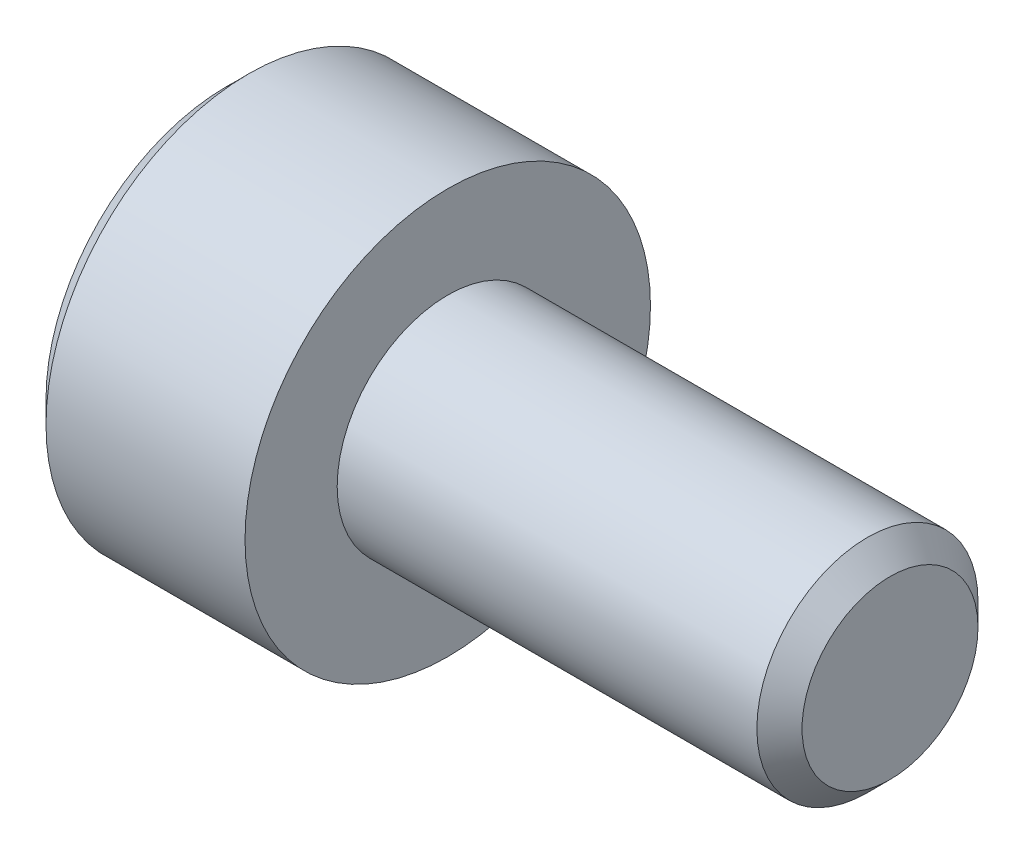
ISO-10303-21;
HEADER;
FILE_DESCRIPTION(('STEP AP214'),'2;1');
FILE_NAME('part.step','',(''),(''),'','','');
FILE_SCHEMA(('AUTOMOTIVE_DESIGN { 1 0 10303 214 1 1 1 1 }'));
ENDSEC;
DATA;
#1=APPLICATION_CONTEXT('core data for automotive mechanical design processes');
#2=APPLICATION_PROTOCOL_DEFINITION('international standard','automotive_design',2000,#1);
#3=PRODUCT_CONTEXT('',#1,'mechanical');
#4=PRODUCT('Part','Part','',(#3));
#5=PRODUCT_RELATED_PRODUCT_CATEGORY('part','',(#4));
#6=PRODUCT_DEFINITION_FORMATION('','',#4);
#7=PRODUCT_DEFINITION_CONTEXT('part definition',#1,'design');
#8=PRODUCT_DEFINITION('design','',#6,#7);
#9=PRODUCT_DEFINITION_SHAPE('','',#8);
#10=(LENGTH_UNIT() NAMED_UNIT(*) SI_UNIT(.MILLI.,.METRE.));
#11=(NAMED_UNIT(*) PLANE_ANGLE_UNIT() SI_UNIT($,.RADIAN.));
#12=(NAMED_UNIT(*) SI_UNIT($,.STERADIAN.) SOLID_ANGLE_UNIT());
#13=UNCERTAINTY_MEASURE_WITH_UNIT(LENGTH_MEASURE(1.E-05),#10,'distance_accuracy_value','');
#14=(GEOMETRIC_REPRESENTATION_CONTEXT(3) GLOBAL_UNCERTAINTY_ASSIGNED_CONTEXT((#13)) GLOBAL_UNIT_ASSIGNED_CONTEXT((#10,
#11,#12)) REPRESENTATION_CONTEXT('',''));
#15=CARTESIAN_POINT('',(0.,0.,0.));
#16=DIRECTION('',(0.,0.,1.));
#17=DIRECTION('',(1.,0.,0.));
#18=AXIS2_PLACEMENT_3D('',#15,#16,#17);
#19=CARTESIAN_POINT('',(-1.5,0.,0.));
#20=DIRECTION('',(-1.,0.,0.));
#21=DIRECTION('',(0.,0.,1.));
#22=AXIS2_PLACEMENT_3D('',#19,#20,#21);
#23=CONICAL_SURFACE('',#22,1.25,1.30899693899575);
#24=CARTESIAN_POINT('',(-1.5,0.,0.));
#25=DIRECTION('',(1.,0.,0.));
#26=DIRECTION('',(0.,0.,-1.));
#27=AXIS2_PLACEMENT_3D('',#24,#25,#26);
#28=CIRCLE('',#27,1.25);
#29=CARTESIAN_POINT('',(-1.5,1.08253175473055,-0.625));
#30=VERTEX_POINT('',#29);
#31=CARTESIAN_POINT('',(-1.5,1.08253175473055,0.625));
#32=VERTEX_POINT('',#31);
#33=EDGE_CURVE('E203',#30,#32,#28,.T.);
#34=ORIENTED_EDGE('',*,*,#33,.F.);
#35=CARTESIAN_POINT('',(-1.5,0.,0.));
#36=DIRECTION('',(1.,0.,0.));
#37=DIRECTION('',(0.,0.,-1.));
#38=AXIS2_PLACEMENT_3D('',#35,#36,#37);
#39=CIRCLE('',#38,1.25);
#40=CARTESIAN_POINT('',(-1.5,0.,-1.25));
#41=VERTEX_POINT('',#40);
#42=EDGE_CURVE('E245',#41,#30,#39,.T.);
#43=ORIENTED_EDGE('',*,*,#42,.F.);
#44=CARTESIAN_POINT('',(-1.5,0.,0.));
#45=DIRECTION('',(1.,0.,0.));
#46=DIRECTION('',(0.,0.,-1.));
#47=AXIS2_PLACEMENT_3D('',#44,#45,#46);
#48=CIRCLE('',#47,1.25);
#49=CARTESIAN_POINT('',(-1.5,-1.08253175473055,-0.625));
#50=VERTEX_POINT('',#49);
#51=EDGE_CURVE('E11',#50,#41,#48,.T.);
#52=ORIENTED_EDGE('',*,*,#51,.F.);
#53=CARTESIAN_POINT('',(-1.5,0.,0.));
#54=DIRECTION('',(1.,0.,0.));
#55=DIRECTION('',(0.,0.,-1.));
#56=AXIS2_PLACEMENT_3D('',#53,#54,#55);
#57=CIRCLE('',#56,1.25);
#58=CARTESIAN_POINT('',(-1.5,-1.08253175473055,0.625));
#59=VERTEX_POINT('',#58);
#60=EDGE_CURVE('E26',#59,#50,#57,.T.);
#61=ORIENTED_EDGE('',*,*,#60,.F.);
#62=CARTESIAN_POINT('',(-1.5,0.,0.));
#63=DIRECTION('',(1.,0.,0.));
#64=DIRECTION('',(0.,0.,-1.));
#65=AXIS2_PLACEMENT_3D('',#62,#63,#64);
#66=CIRCLE('',#65,1.25);
#67=CARTESIAN_POINT('',(-1.5,0.,1.25));
#68=VERTEX_POINT('',#67);
#69=EDGE_CURVE('E202',#68,#59,#66,.T.);
#70=ORIENTED_EDGE('',*,*,#69,.F.);
#71=CARTESIAN_POINT('',(-1.5,0.,0.));
#72=DIRECTION('',(1.,0.,0.));
#73=DIRECTION('',(0.,0.,-1.));
#74=AXIS2_PLACEMENT_3D('',#71,#72,#73);
#75=CIRCLE('',#74,1.25);
#76=EDGE_CURVE('E38',#32,#68,#75,.T.);
#77=ORIENTED_EDGE('',*,*,#76,.F.);
#78=EDGE_LOOP('',(#34,#43,#52,#61,#70,#77));
#79=FACE_BOUND('',#78,.T.);
#80=CARTESIAN_POINT('',(-1.1650635094611,0.,0.));
#81=VERTEX_POINT('',#80);
#82=VERTEX_LOOP('',#81);
#83=FACE_BOUND('',#82,.T.);
#84=ADVANCED_FACE('F17',(#79,#83),#23,.F.);
#85=CARTESIAN_POINT('',(-1.5,0.,0.));
#86=DIRECTION('',(1.,0.,0.));
#87=DIRECTION('',(0.,1.,0.));
#88=AXIS2_PLACEMENT_3D('',#85,#86,#87);
#89=PLANE('',#88);
#90=ORIENTED_EDGE('',*,*,#51,.T.);
#91=DIRECTION('',(0.,1.,0.));
#92=VECTOR('',#91,1.);
#93=CARTESIAN_POINT('',(-1.5,-0.721687836487032,-1.25));
#94=LINE('',#93,#92);
#95=CARTESIAN_POINT('',(-1.5,-0.721687836487032,-1.25));
#96=VERTEX_POINT('',#95);
#97=EDGE_CURVE('E176',#96,#41,#94,.T.);
#98=ORIENTED_EDGE('',*,*,#97,.F.);
#99=DIRECTION('',(0.,0.5,-0.866025403784439));
#100=VECTOR('',#99,1.);
#101=CARTESIAN_POINT('',(-1.5,-1.44337567297406,0.));
#102=LINE('',#101,#100);
#103=EDGE_CURVE('E154',#50,#96,#102,.T.);
#104=ORIENTED_EDGE('',*,*,#103,.F.);
#105=EDGE_LOOP('',(#90,#98,#104));
#106=FACE_BOUND('',#105,.T.);
#107=ADVANCED_FACE('F217',(#106),#89,.F.);
#108=CARTESIAN_POINT('',(-1.5,0.,0.));
#109=DIRECTION('',(1.,0.,0.));
#110=DIRECTION('',(0.,1.,0.));
#111=AXIS2_PLACEMENT_3D('',#108,#109,#110);
#112=PLANE('',#111);
#113=ORIENTED_EDGE('',*,*,#60,.T.);
#114=DIRECTION('',(0.,0.5,-0.866025403784439));
#115=VECTOR('',#114,1.);
#116=CARTESIAN_POINT('',(-1.5,-1.44337567297406,0.));
#117=LINE('',#116,#115);
#118=CARTESIAN_POINT('',(-1.5,-1.44337567297406,0.));
#119=VERTEX_POINT('',#118);
#120=EDGE_CURVE('E150',#119,#50,#117,.T.);
#121=ORIENTED_EDGE('',*,*,#120,.F.);
#122=DIRECTION('',(0.,-0.5,-0.866025403784439));
#123=VECTOR('',#122,1.);
#124=CARTESIAN_POINT('',(-1.5,-0.721687836487032,1.25));
#125=LINE('',#124,#123);
#126=EDGE_CURVE('E167',#59,#119,#125,.T.);
#127=ORIENTED_EDGE('',*,*,#126,.F.);
#128=EDGE_LOOP('',(#113,#121,#127));
#129=FACE_BOUND('',#128,.T.);
#130=ADVANCED_FACE('F213',(#129),#112,.F.);
#131=CARTESIAN_POINT('',(-1.5,0.,0.));
#132=DIRECTION('',(1.,0.,0.));
#133=DIRECTION('',(0.,1.,0.));
#134=AXIS2_PLACEMENT_3D('',#131,#132,#133);
#135=PLANE('',#134);
#136=ORIENTED_EDGE('',*,*,#69,.T.);
#137=DIRECTION('',(0.,-0.5,-0.866025403784439));
#138=VECTOR('',#137,1.);
#139=CARTESIAN_POINT('',(-1.5,-0.721687836487032,1.25));
#140=LINE('',#139,#138);
#141=CARTESIAN_POINT('',(-1.5,-0.721687836487032,1.25));
#142=VERTEX_POINT('',#141);
#143=EDGE_CURVE('E159',#142,#59,#140,.T.);
#144=ORIENTED_EDGE('',*,*,#143,.F.);
#145=DIRECTION('',(0.,-1.,0.));
#146=VECTOR('',#145,1.);
#147=CARTESIAN_POINT('',(-1.5,0.721687836487032,1.25));
#148=LINE('',#147,#146);
#149=EDGE_CURVE('E160',#68,#142,#148,.T.);
#150=ORIENTED_EDGE('',*,*,#149,.F.);
#151=EDGE_LOOP('',(#136,#144,#150));
#152=FACE_BOUND('',#151,.T.);
#153=ADVANCED_FACE('F235',(#152),#135,.F.);
#154=CARTESIAN_POINT('',(-1.5,0.,0.));
#155=DIRECTION('',(1.,0.,0.));
#156=DIRECTION('',(0.,1.,0.));
#157=AXIS2_PLACEMENT_3D('',#154,#155,#156);
#158=PLANE('',#157);
#159=ORIENTED_EDGE('',*,*,#76,.T.);
#160=DIRECTION('',(0.,-1.,0.));
#161=VECTOR('',#160,1.);
#162=CARTESIAN_POINT('',(-1.5,0.721687836487032,1.25));
#163=LINE('',#162,#161);
#164=CARTESIAN_POINT('',(-1.5,0.721687836487032,1.25));
#165=VERTEX_POINT('',#164);
#166=EDGE_CURVE('E143',#165,#68,#163,.T.);
#167=ORIENTED_EDGE('',*,*,#166,.F.);
#168=DIRECTION('',(0.,-0.5,0.866025403784439));
#169=VECTOR('',#168,1.);
#170=CARTESIAN_POINT('',(-1.5,1.44337567297406,0.));
#171=LINE('',#170,#169);
#172=EDGE_CURVE('E199',#32,#165,#171,.T.);
#173=ORIENTED_EDGE('',*,*,#172,.F.);
#174=EDGE_LOOP('',(#159,#167,#173));
#175=FACE_BOUND('',#174,.T.);
#176=ADVANCED_FACE('F241',(#175),#158,.F.);
#177=CARTESIAN_POINT('',(-1.5,0.,0.));
#178=DIRECTION('',(1.,0.,0.));
#179=DIRECTION('',(0.,1.,0.));
#180=AXIS2_PLACEMENT_3D('',#177,#178,#179);
#181=PLANE('',#180);
#182=DIRECTION('',(0.,0.5,0.866025403784439));
#183=VECTOR('',#182,1.);
#184=CARTESIAN_POINT('',(-1.5,0.721687836487032,-1.25));
#185=LINE('',#184,#183);
#186=CARTESIAN_POINT('',(-1.5,1.44337567297406,0.));
#187=VERTEX_POINT('',#186);
#188=EDGE_CURVE('E188',#30,#187,#185,.T.);
#189=ORIENTED_EDGE('',*,*,#188,.F.);
#190=ORIENTED_EDGE('',*,*,#33,.T.);
#191=DIRECTION('',(0.,-0.5,0.866025403784439));
#192=VECTOR('',#191,1.);
#193=CARTESIAN_POINT('',(-1.5,1.44337567297406,0.));
#194=LINE('',#193,#192);
#195=EDGE_CURVE('E195',#187,#32,#194,.T.);
#196=ORIENTED_EDGE('',*,*,#195,.F.);
#197=EDGE_LOOP('',(#189,#190,#196));
#198=FACE_BOUND('',#197,.T.);
#199=ADVANCED_FACE('F252',(#198),#181,.F.);
#200=CARTESIAN_POINT('',(-1.5,0.,0.));
#201=DIRECTION('',(1.,0.,0.));
#202=DIRECTION('',(0.,1.,0.));
#203=AXIS2_PLACEMENT_3D('',#200,#201,#202);
#204=PLANE('',#203);
#205=ORIENTED_EDGE('',*,*,#42,.T.);
#206=DIRECTION('',(0.,0.5,0.866025403784439));
#207=VECTOR('',#206,1.);
#208=CARTESIAN_POINT('',(-1.5,0.721687836487032,-1.25));
#209=LINE('',#208,#207);
#210=CARTESIAN_POINT('',(-1.5,0.721687836487032,-1.25));
#211=VERTEX_POINT('',#210);
#212=EDGE_CURVE('E184',#211,#30,#209,.T.);
#213=ORIENTED_EDGE('',*,*,#212,.F.);
#214=DIRECTION('',(0.,1.,0.));
#215=VECTOR('',#214,1.);
#216=CARTESIAN_POINT('',(-1.5,-0.721687836487032,-1.25));
#217=LINE('',#216,#215);
#218=EDGE_CURVE('E177',#41,#211,#217,.T.);
#219=ORIENTED_EDGE('',*,*,#218,.F.);
#220=EDGE_LOOP('',(#205,#213,#219));
#221=FACE_BOUND('',#220,.T.);
#222=ADVANCED_FACE('F306',(#221),#204,.F.);
#223=CARTESIAN_POINT('',(-1.5,1.44337567297406,0.));
#224=DIRECTION('',(0.,-0.866025403784439,-0.5));
#225=DIRECTION('',(0.,0.5,-0.866025403784439));
#226=AXIS2_PLACEMENT_3D('',#223,#224,#225);
#227=PLANE('',#226);
#228=DIRECTION('',(0.,-0.5,0.866025403784439));
#229=VECTOR('',#228,1.);
#230=CARTESIAN_POINT('',(-3.,1.44337567297406,0.));
#231=LINE('',#230,#229);
#232=CARTESIAN_POINT('',(-3.,1.44337567297406,0.));
#233=VERTEX_POINT('',#232);
#234=CARTESIAN_POINT('',(-3.,0.721687836487032,1.25));
#235=VERTEX_POINT('',#234);
#236=EDGE_CURVE('E281',#233,#235,#231,.T.);
#237=ORIENTED_EDGE('',*,*,#236,.F.);
#238=DIRECTION('',(-1.,0.,0.));
#239=VECTOR('',#238,1.);
#240=CARTESIAN_POINT('',(-1.5,1.44337567297406,0.));
#241=LINE('',#240,#239);
#242=EDGE_CURVE('E192',#187,#233,#241,.T.);
#243=ORIENTED_EDGE('',*,*,#242,.F.);
#244=ORIENTED_EDGE('',*,*,#195,.T.);
#245=ORIENTED_EDGE('',*,*,#172,.T.);
#246=DIRECTION('',(-1.,0.,0.));
#247=VECTOR('',#246,1.);
#248=CARTESIAN_POINT('',(-1.5,0.721687836487032,1.25));
#249=LINE('',#248,#247);
#250=EDGE_CURVE('E135',#165,#235,#249,.T.);
#251=ORIENTED_EDGE('',*,*,#250,.T.);
#252=EDGE_LOOP('',(#237,#243,#244,#245,#251));
#253=FACE_BOUND('',#252,.T.);
#254=ADVANCED_FACE('F249',(#253),#227,.T.);
#255=CARTESIAN_POINT('',(-1.5,0.721687836487032,-1.25));
#256=DIRECTION('',(0.,-0.866025403784439,0.5));
#257=DIRECTION('',(-1.,0.,0.));
#258=AXIS2_PLACEMENT_3D('',#255,#256,#257);
#259=PLANE('',#258);
#260=DIRECTION('',(0.,0.5,0.866025403784439));
#261=VECTOR('',#260,1.);
#262=CARTESIAN_POINT('',(-3.,0.721687836487032,-1.25));
#263=LINE('',#262,#261);
#264=CARTESIAN_POINT('',(-3.,0.721687836487032,-1.25));
#265=VERTEX_POINT('',#264);
#266=EDGE_CURVE('E273',#265,#233,#263,.T.);
#267=ORIENTED_EDGE('',*,*,#266,.F.);
#268=DIRECTION('',(-1.,0.,0.));
#269=VECTOR('',#268,1.);
#270=CARTESIAN_POINT('',(-1.5,0.721687836487032,-1.25));
#271=LINE('',#270,#269);
#272=EDGE_CURVE('E181',#211,#265,#271,.T.);
#273=ORIENTED_EDGE('',*,*,#272,.F.);
#274=ORIENTED_EDGE('',*,*,#212,.T.);
#275=ORIENTED_EDGE('',*,*,#188,.T.);
#276=ORIENTED_EDGE('',*,*,#242,.T.);
#277=EDGE_LOOP('',(#267,#273,#274,#275,#276));
#278=FACE_BOUND('',#277,.T.);
#279=ADVANCED_FACE('F303',(#278),#259,.T.);
#280=CARTESIAN_POINT('',(-1.5,-0.721687836487032,-1.25));
#281=DIRECTION('',(0.,0.,1.));
#282=DIRECTION('',(1.,0.,0.));
#283=AXIS2_PLACEMENT_3D('',#280,#281,#282);
#284=PLANE('',#283);
#285=DIRECTION('',(0.,1.,0.));
#286=VECTOR('',#285,1.);
#287=CARTESIAN_POINT('',(-3.,-0.721687836487032,-1.25));
#288=LINE('',#287,#286);
#289=CARTESIAN_POINT('',(-3.,-0.721687836487032,-1.25));
#290=VERTEX_POINT('',#289);
#291=EDGE_CURVE('E265',#290,#265,#288,.T.);
#292=ORIENTED_EDGE('',*,*,#291,.F.);
#293=DIRECTION('',(-1.,0.,0.));
#294=VECTOR('',#293,1.);
#295=CARTESIAN_POINT('',(-1.5,-0.721687836487032,-1.25));
#296=LINE('',#295,#294);
#297=EDGE_CURVE('E173',#96,#290,#296,.T.);
#298=ORIENTED_EDGE('',*,*,#297,.F.);
#299=ORIENTED_EDGE('',*,*,#97,.T.);
#300=ORIENTED_EDGE('',*,*,#218,.T.);
#301=ORIENTED_EDGE('',*,*,#272,.T.);
#302=EDGE_LOOP('',(#292,#298,#299,#300,#301));
#303=FACE_BOUND('',#302,.T.);
#304=ADVANCED_FACE('F308',(#303),#284,.T.);
#305=CARTESIAN_POINT('',(-1.5,-1.44337567297406,0.));
#306=DIRECTION('',(0.,0.866025403784439,0.5));
#307=DIRECTION('',(1.,0.,0.));
#308=AXIS2_PLACEMENT_3D('',#305,#306,#307);
#309=PLANE('',#308);
#310=DIRECTION('',(0.,0.5,-0.866025403784439));
#311=VECTOR('',#310,1.);
#312=CARTESIAN_POINT('',(-3.,-1.44337567297406,0.));
#313=LINE('',#312,#311);
#314=CARTESIAN_POINT('',(-3.,-1.44337567297406,0.));
#315=VERTEX_POINT('',#314);
#316=EDGE_CURVE('E227',#315,#290,#313,.T.);
#317=ORIENTED_EDGE('',*,*,#316,.F.);
#318=DIRECTION('',(-1.,0.,0.));
#319=VECTOR('',#318,1.);
#320=CARTESIAN_POINT('',(-1.5,-1.44337567297406,0.));
#321=LINE('',#320,#319);
#322=EDGE_CURVE('E155',#119,#315,#321,.T.);
#323=ORIENTED_EDGE('',*,*,#322,.F.);
#324=ORIENTED_EDGE('',*,*,#120,.T.);
#325=ORIENTED_EDGE('',*,*,#103,.T.);
#326=ORIENTED_EDGE('',*,*,#297,.T.);
#327=EDGE_LOOP('',(#317,#323,#324,#325,#326));
#328=FACE_BOUND('',#327,.T.);
#329=ADVANCED_FACE('F225',(#328),#309,.T.);
#330=CARTESIAN_POINT('',(-1.5,-0.721687836487032,1.25));
#331=DIRECTION('',(0.,0.866025403784439,-0.5));
#332=DIRECTION('',(-1.,0.,0.));
#333=AXIS2_PLACEMENT_3D('',#330,#331,#332);
#334=PLANE('',#333);
#335=DIRECTION('',(0.,-0.5,-0.866025403784439));
#336=VECTOR('',#335,1.);
#337=CARTESIAN_POINT('',(-3.,-0.721687836487032,1.25));
#338=LINE('',#337,#336);
#339=CARTESIAN_POINT('',(-3.,-0.721687836487032,1.25));
#340=VERTEX_POINT('',#339);
#341=EDGE_CURVE('E277',#340,#315,#338,.T.);
#342=ORIENTED_EDGE('',*,*,#341,.F.);
#343=DIRECTION('',(-1.,0.,0.));
#344=VECTOR('',#343,1.);
#345=CARTESIAN_POINT('',(-1.5,-0.721687836487032,1.25));
#346=LINE('',#345,#344);
#347=EDGE_CURVE('E156',#142,#340,#346,.T.);
#348=ORIENTED_EDGE('',*,*,#347,.F.);
#349=ORIENTED_EDGE('',*,*,#143,.T.);
#350=ORIENTED_EDGE('',*,*,#126,.T.);
#351=ORIENTED_EDGE('',*,*,#322,.T.);
#352=EDGE_LOOP('',(#342,#348,#349,#350,#351));
#353=FACE_BOUND('',#352,.T.);
#354=ADVANCED_FACE('F231',(#353),#334,.T.);
#355=CARTESIAN_POINT('',(-1.5,0.721687836487032,1.25));
#356=DIRECTION('',(0.,0.,-1.));
#357=DIRECTION('',(0.,-1.,0.));
#358=AXIS2_PLACEMENT_3D('',#355,#356,#357);
#359=PLANE('',#358);
#360=DIRECTION('',(0.,-1.,0.));
#361=VECTOR('',#360,1.);
#362=CARTESIAN_POINT('',(-3.,0.721687836487032,1.25));
#363=LINE('',#362,#361);
#364=EDGE_CURVE('E287',#235,#340,#363,.T.);
#365=ORIENTED_EDGE('',*,*,#364,.F.);
#366=ORIENTED_EDGE('',*,*,#250,.F.);
#367=ORIENTED_EDGE('',*,*,#166,.T.);
#368=ORIENTED_EDGE('',*,*,#149,.T.);
#369=ORIENTED_EDGE('',*,*,#347,.T.);
#370=EDGE_LOOP('',(#365,#366,#367,#368,#369));
#371=FACE_BOUND('',#370,.T.);
#372=ADVANCED_FACE('F298',(#371),#359,.T.);
#373=CARTESIAN_POINT('',(6.,1.1935,0.));
#374=DIRECTION('',(-1.,0.,0.));
#375=DIRECTION('',(0.,0.,1.));
#376=AXIS2_PLACEMENT_3D('',#373,#374,#375);
#377=PLANE('',#376);
#378=CARTESIAN_POINT('',(6.,0.,0.));
#379=DIRECTION('',(1.,0.,0.));
#380=DIRECTION('',(0.,0.,-1.));
#381=AXIS2_PLACEMENT_3D('',#378,#379,#380);
#382=CIRCLE('',#381,1.1935);
#383=CARTESIAN_POINT('',(6.,0.,-1.1935));
#384=VERTEX_POINT('',#383);
#385=EDGE_CURVE('E131',#384,#384,#382,.T.);
#386=ORIENTED_EDGE('',*,*,#385,.T.);
#387=EDGE_LOOP('',(#386));
#388=FACE_BOUND('',#387,.T.);
#389=ADVANCED_FACE('F132',(#388),#377,.F.);
#390=CARTESIAN_POINT('',(5.6935,0.,0.));
#391=DIRECTION('',(-1.,0.,0.));
#392=DIRECTION('',(0.,0.,1.));
#393=AXIS2_PLACEMENT_3D('',#390,#391,#392);
#394=CONICAL_SURFACE('',#393,1.5,0.785398163397449);
#395=CARTESIAN_POINT('',(5.6935,0.,0.));
#396=DIRECTION('',(1.,0.,0.));
#397=DIRECTION('',(0.,0.,-1.));
#398=AXIS2_PLACEMENT_3D('',#395,#396,#397);
#399=CIRCLE('',#398,1.5);
#400=CARTESIAN_POINT('',(5.6935,0.,-1.5));
#401=VERTEX_POINT('',#400);
#402=EDGE_CURVE('E136',#401,#401,#399,.T.);
#403=ORIENTED_EDGE('',*,*,#402,.T.);
#404=EDGE_LOOP('',(#403));
#405=FACE_BOUND('',#404,.T.);
#406=ORIENTED_EDGE('',*,*,#385,.F.);
#407=EDGE_LOOP('',(#406));
#408=FACE_BOUND('',#407,.T.);
#409=ADVANCED_FACE('F413',(#405,#408),#394,.T.);
#410=CARTESIAN_POINT('',(6.,0.,0.));
#411=DIRECTION('',(1.,0.,0.));
#412=DIRECTION('',(0.,0.,-1.));
#413=AXIS2_PLACEMENT_3D('',#410,#411,#412);
#414=CYLINDRICAL_SURFACE('',#413,1.5);
#415=CARTESIAN_POINT('',(0.,0.,0.));
#416=DIRECTION('',(1.,0.,0.));
#417=DIRECTION('',(0.,0.,-1.));
#418=AXIS2_PLACEMENT_3D('',#415,#416,#417);
#419=CIRCLE('',#418,1.5);
#420=CARTESIAN_POINT('',(0.,0.,-1.5));
#421=VERTEX_POINT('',#420);
#422=EDGE_CURVE('E145',#421,#421,#419,.T.);
#423=ORIENTED_EDGE('',*,*,#422,.T.);
#424=EDGE_LOOP('',(#423));
#425=FACE_BOUND('',#424,.T.);
#426=ORIENTED_EDGE('',*,*,#402,.F.);
#427=EDGE_LOOP('',(#426));
#428=FACE_BOUND('',#427,.T.);
#429=ADVANCED_FACE('F423',(#425,#428),#414,.T.);
#430=CARTESIAN_POINT('',(0.,2.75,0.));
#431=DIRECTION('',(-1.,0.,0.));
#432=DIRECTION('',(0.,0.,1.));
#433=AXIS2_PLACEMENT_3D('',#430,#431,#432);
#434=PLANE('',#433);
#435=CARTESIAN_POINT('',(0.,0.,0.));
#436=DIRECTION('',(1.,0.,0.));
#437=DIRECTION('',(0.,0.,-1.));
#438=AXIS2_PLACEMENT_3D('',#435,#436,#437);
#439=CIRCLE('',#438,2.75);
#440=CARTESIAN_POINT('',(0.,0.,-2.75));
#441=VERTEX_POINT('',#440);
#442=EDGE_CURVE('E262',#441,#441,#439,.T.);
#443=ORIENTED_EDGE('',*,*,#442,.T.);
#444=EDGE_LOOP('',(#443));
#445=FACE_BOUND('',#444,.T.);
#446=ORIENTED_EDGE('',*,*,#422,.F.);
#447=EDGE_LOOP('',(#446));
#448=FACE_BOUND('',#447,.T.);
#449=ADVANCED_FACE('F434',(#445,#448),#434,.F.);
#450=CARTESIAN_POINT('',(6.,0.,0.));
#451=DIRECTION('',(1.,0.,0.));
#452=DIRECTION('',(0.,0.,-1.));
#453=AXIS2_PLACEMENT_3D('',#450,#451,#452);
#454=CYLINDRICAL_SURFACE('',#453,2.75);
#455=CARTESIAN_POINT('',(-2.7,0.,0.));
#456=DIRECTION('',(1.,0.,0.));
#457=DIRECTION('',(0.,0.,-1.));
#458=AXIS2_PLACEMENT_3D('',#455,#456,#457);
#459=CIRCLE('',#458,2.75);
#460=CARTESIAN_POINT('',(-2.7,0.,-2.75));
#461=VERTEX_POINT('',#460);
#462=EDGE_CURVE('E274',#461,#461,#459,.T.);
#463=ORIENTED_EDGE('',*,*,#462,.T.);
#464=EDGE_LOOP('',(#463));
#465=FACE_BOUND('',#464,.T.);
#466=ORIENTED_EDGE('',*,*,#442,.F.);
#467=EDGE_LOOP('',(#466));
#468=FACE_BOUND('',#467,.T.);
#469=ADVANCED_FACE('F445',(#465,#468),#454,.T.);
#470=CARTESIAN_POINT('',(-3.,0.,0.));
#471=DIRECTION('',(1.,0.,0.));
#472=DIRECTION('',(0.,0.,-1.));
#473=AXIS2_PLACEMENT_3D('',#470,#471,#472);
#474=CONICAL_SURFACE('',#473,2.45,0.785398163397445);
#475=CARTESIAN_POINT('',(-3.,0.,0.));
#476=DIRECTION('',(1.,0.,0.));
#477=DIRECTION('',(0.,0.,-1.));
#478=AXIS2_PLACEMENT_3D('',#475,#476,#477);
#479=CIRCLE('',#478,2.45);
#480=CARTESIAN_POINT('',(-3.,0.,-2.45));
#481=VERTEX_POINT('',#480);
#482=EDGE_CURVE('E266',#481,#481,#479,.T.);
#483=ORIENTED_EDGE('',*,*,#482,.T.);
#484=EDGE_LOOP('',(#483));
#485=FACE_BOUND('',#484,.T.);
#486=ORIENTED_EDGE('',*,*,#462,.F.);
#487=EDGE_LOOP('',(#486));
#488=FACE_BOUND('',#487,.T.);
#489=ADVANCED_FACE('F456',(#485,#488),#474,.T.);
#490=CARTESIAN_POINT('',(-3.,0.,0.));
#491=DIRECTION('',(1.,0.,0.));
#492=DIRECTION('',(0.,1.,0.));
#493=AXIS2_PLACEMENT_3D('',#490,#491,#492);
#494=PLANE('',#493);
#495=ORIENTED_EDGE('',*,*,#316,.T.);
#496=ORIENTED_EDGE('',*,*,#291,.T.);
#497=ORIENTED_EDGE('',*,*,#266,.T.);
#498=ORIENTED_EDGE('',*,*,#236,.T.);
#499=ORIENTED_EDGE('',*,*,#364,.T.);
#500=ORIENTED_EDGE('',*,*,#341,.T.);
#501=EDGE_LOOP('',(#495,#496,#497,#498,#499,#500));
#502=FACE_BOUND('',#501,.T.);
#503=ORIENTED_EDGE('',*,*,#482,.F.);
#504=EDGE_LOOP('',(#503));
#505=FACE_BOUND('',#504,.T.);
#506=ADVANCED_FACE('F295',(#502,#505),#494,.F.);
#507=CLOSED_SHELL('',(#84,#107,#130,#153,#176,#199,#222,#254,#279,#304,#329,#354,#372,#389,#409,
#429,#449,#469,#489,#506));
#508=MANIFOLD_SOLID_BREP('B1',#507);
#509=ADVANCED_BREP_SHAPE_REPRESENTATION('',(#18,#508),#14);
#510=SHAPE_DEFINITION_REPRESENTATION(#9,#509);
ENDSEC;
END-ISO-10303-21;
